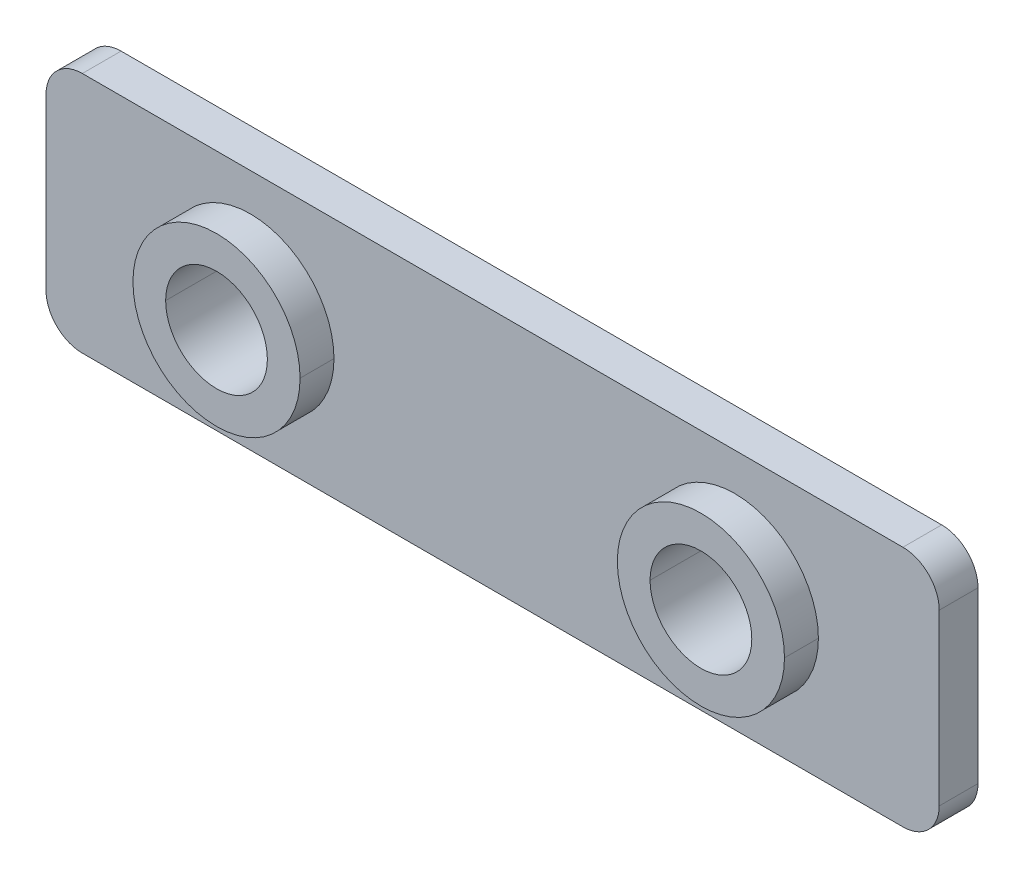
ISO-10303-21;
HEADER;
FILE_DESCRIPTION(('STEP AP214'),'2;1');
FILE_NAME('part.step','',(''),(''),'','','');
FILE_SCHEMA(('AUTOMOTIVE_DESIGN { 1 0 10303 214 1 1 1 1 }'));
ENDSEC;
DATA;
#1=APPLICATION_CONTEXT('core data for automotive mechanical design processes');
#2=APPLICATION_PROTOCOL_DEFINITION('international standard','automotive_design',2000,#1);
#3=PRODUCT_CONTEXT('',#1,'mechanical');
#4=PRODUCT('Part','Part','',(#3));
#5=PRODUCT_RELATED_PRODUCT_CATEGORY('part','',(#4));
#6=PRODUCT_DEFINITION_FORMATION('','',#4);
#7=PRODUCT_DEFINITION_CONTEXT('part definition',#1,'design');
#8=PRODUCT_DEFINITION('design','',#6,#7);
#9=PRODUCT_DEFINITION_SHAPE('','',#8);
#10=(LENGTH_UNIT() NAMED_UNIT(*) SI_UNIT(.MILLI.,.METRE.));
#11=(NAMED_UNIT(*) PLANE_ANGLE_UNIT() SI_UNIT($,.RADIAN.));
#12=(NAMED_UNIT(*) SI_UNIT($,.STERADIAN.) SOLID_ANGLE_UNIT());
#13=UNCERTAINTY_MEASURE_WITH_UNIT(LENGTH_MEASURE(1.E-05),#10,'distance_accuracy_value','');
#14=(GEOMETRIC_REPRESENTATION_CONTEXT(3) GLOBAL_UNCERTAINTY_ASSIGNED_CONTEXT((#13)) GLOBAL_UNIT_ASSIGNED_CONTEXT((#10,
#11,#12)) REPRESENTATION_CONTEXT('',''));
#15=CARTESIAN_POINT('',(0.,0.,0.));
#16=DIRECTION('',(0.,0.,1.));
#17=DIRECTION('',(1.,0.,0.));
#18=AXIS2_PLACEMENT_3D('',#15,#16,#17);
#19=CARTESIAN_POINT('',(8.44,5.,3.));
#20=DIRECTION('',(0.,0.,1.));
#21=DIRECTION('',(1.,0.,0.));
#22=AXIS2_PLACEMENT_3D('',#19,#20,#21);
#23=CYLINDRICAL_SURFACE('',#22,2.1);
#24=DIRECTION('',(0.,0.,1.));
#25=VECTOR('',#24,1.);
#26=CARTESIAN_POINT('',(6.34,5.,3.));
#27=LINE('',#26,#25);
#28=CARTESIAN_POINT('',(6.34,5.,0.));
#29=VERTEX_POINT('',#28);
#30=CARTESIAN_POINT('',(6.34,5.,3.));
#31=VERTEX_POINT('',#30);
#32=EDGE_CURVE('E220',#29,#31,#27,.T.);
#33=ORIENTED_EDGE('',*,*,#32,.F.);
#34=CARTESIAN_POINT('',(8.44,5.,0.));
#35=DIRECTION('',(0.,0.,1.));
#36=DIRECTION('',(1.,0.,0.));
#37=AXIS2_PLACEMENT_3D('',#34,#35,#36);
#38=CIRCLE('',#37,2.1);
#39=CARTESIAN_POINT('',(10.54,5.,0.));
#40=VERTEX_POINT('',#39);
#41=EDGE_CURVE('E205',#40,#29,#38,.T.);
#42=ORIENTED_EDGE('',*,*,#41,.F.);
#43=DIRECTION('',(0.,0.,1.));
#44=VECTOR('',#43,1.);
#45=CARTESIAN_POINT('',(10.54,5.,3.));
#46=LINE('',#45,#44);
#47=CARTESIAN_POINT('',(10.54,5.,3.));
#48=VERTEX_POINT('',#47);
#49=EDGE_CURVE('E225',#40,#48,#46,.T.);
#50=ORIENTED_EDGE('',*,*,#49,.T.);
#51=CARTESIAN_POINT('',(8.44,5.,3.));
#52=DIRECTION('',(0.,0.,1.));
#53=DIRECTION('',(1.,0.,0.));
#54=AXIS2_PLACEMENT_3D('',#51,#52,#53);
#55=CIRCLE('',#54,2.1);
#56=EDGE_CURVE('E200',#48,#31,#55,.T.);
#57=ORIENTED_EDGE('',*,*,#56,.T.);
#58=EDGE_LOOP('',(#33,#42,#50,#57));
#59=FACE_BOUND('',#58,.T.);
#60=ADVANCED_FACE('F17',(#59),#23,.F.);
#61=CARTESIAN_POINT('',(28.44,5.,3.));
#62=DIRECTION('',(0.,0.,1.));
#63=DIRECTION('',(1.,0.,0.));
#64=AXIS2_PLACEMENT_3D('',#61,#62,#63);
#65=CYLINDRICAL_SURFACE('',#64,2.1);
#66=DIRECTION('',(0.,0.,1.));
#67=VECTOR('',#66,1.);
#68=CARTESIAN_POINT('',(26.34,5.,3.));
#69=LINE('',#68,#67);
#70=CARTESIAN_POINT('',(26.34,5.,0.));
#71=VERTEX_POINT('',#70);
#72=CARTESIAN_POINT('',(26.34,5.,3.));
#73=VERTEX_POINT('',#72);
#74=EDGE_CURVE('E230',#71,#73,#69,.T.);
#75=ORIENTED_EDGE('',*,*,#74,.F.);
#76=CARTESIAN_POINT('',(28.44,5.,0.));
#77=DIRECTION('',(0.,0.,1.));
#78=DIRECTION('',(1.,0.,0.));
#79=AXIS2_PLACEMENT_3D('',#76,#77,#78);
#80=CIRCLE('',#79,2.1);
#81=CARTESIAN_POINT('',(30.54,5.,0.));
#82=VERTEX_POINT('',#81);
#83=EDGE_CURVE('E100',#82,#71,#80,.T.);
#84=ORIENTED_EDGE('',*,*,#83,.F.);
#85=DIRECTION('',(0.,0.,1.));
#86=VECTOR('',#85,1.);
#87=CARTESIAN_POINT('',(30.54,5.,3.));
#88=LINE('',#87,#86);
#89=CARTESIAN_POINT('',(30.54,5.,3.));
#90=VERTEX_POINT('',#89);
#91=EDGE_CURVE('E259',#82,#90,#88,.T.);
#92=ORIENTED_EDGE('',*,*,#91,.T.);
#93=CARTESIAN_POINT('',(28.44,5.,3.));
#94=DIRECTION('',(0.,0.,1.));
#95=DIRECTION('',(1.,0.,0.));
#96=AXIS2_PLACEMENT_3D('',#93,#94,#95);
#97=CIRCLE('',#96,2.1);
#98=EDGE_CURVE('E11',#90,#73,#97,.T.);
#99=ORIENTED_EDGE('',*,*,#98,.T.);
#100=EDGE_LOOP('',(#75,#84,#92,#99));
#101=FACE_BOUND('',#100,.T.);
#102=ADVANCED_FACE('F533',(#101),#65,.F.);
#103=CARTESIAN_POINT('',(28.44,5.,3.));
#104=DIRECTION('',(0.,0.,-1.));
#105=DIRECTION('',(0.,-1.,0.));
#106=AXIS2_PLACEMENT_3D('',#103,#104,#105);
#107=PLANE('',#106);
#108=ORIENTED_EDGE('',*,*,#98,.F.);
#109=CARTESIAN_POINT('',(28.44,5.,3.));
#110=DIRECTION('',(0.,0.,1.));
#111=DIRECTION('',(1.,0.,0.));
#112=AXIS2_PLACEMENT_3D('',#109,#110,#111);
#113=CIRCLE('',#112,2.1);
#114=EDGE_CURVE('E234',#73,#90,#113,.T.);
#115=ORIENTED_EDGE('',*,*,#114,.F.);
#116=EDGE_LOOP('',(#108,#115));
#117=FACE_BOUND('',#116,.T.);
#118=CARTESIAN_POINT('',(28.44,5.,3.));
#119=DIRECTION('',(0.,0.,1.));
#120=DIRECTION('',(-1.,0.,0.));
#121=AXIS2_PLACEMENT_3D('',#118,#119,#120);
#122=CIRCLE('',#121,3.45);
#123=CARTESIAN_POINT('',(24.99,5.,3.));
#124=VERTEX_POINT('',#123);
#125=CARTESIAN_POINT('',(31.89,5.,3.));
#126=VERTEX_POINT('',#125);
#127=EDGE_CURVE('E28',#124,#126,#122,.T.);
#128=ORIENTED_EDGE('',*,*,#127,.T.);
#129=CARTESIAN_POINT('',(28.44,5.,3.));
#130=DIRECTION('',(0.,0.,1.));
#131=DIRECTION('',(-1.,0.,0.));
#132=AXIS2_PLACEMENT_3D('',#129,#130,#131);
#133=CIRCLE('',#132,3.45);
#134=EDGE_CURVE('E21',#126,#124,#133,.T.);
#135=ORIENTED_EDGE('',*,*,#134,.T.);
#136=EDGE_LOOP('',(#128,#135));
#137=FACE_BOUND('',#136,.T.);
#138=ADVANCED_FACE('F537',(#117,#137),#107,.F.);
#139=CARTESIAN_POINT('',(28.44,5.,3.));
#140=DIRECTION('',(0.,0.,-1.));
#141=DIRECTION('',(-1.,0.,0.));
#142=AXIS2_PLACEMENT_3D('',#139,#140,#141);
#143=CYLINDRICAL_SURFACE('',#142,3.45);
#144=DIRECTION('',(0.,0.,-1.));
#145=VECTOR('',#144,1.);
#146=CARTESIAN_POINT('',(31.89,5.,3.));
#147=LINE('',#146,#145);
#148=CARTESIAN_POINT('',(31.89,5.,1.6));
#149=VERTEX_POINT('',#148);
#150=EDGE_CURVE('E244',#126,#149,#147,.T.);
#151=ORIENTED_EDGE('',*,*,#150,.F.);
#152=ORIENTED_EDGE('',*,*,#127,.F.);
#153=DIRECTION('',(0.,0.,-1.));
#154=VECTOR('',#153,1.);
#155=CARTESIAN_POINT('',(24.99,5.,3.));
#156=LINE('',#155,#154);
#157=CARTESIAN_POINT('',(24.99,5.,1.6));
#158=VERTEX_POINT('',#157);
#159=EDGE_CURVE('E270',#124,#158,#156,.T.);
#160=ORIENTED_EDGE('',*,*,#159,.T.);
#161=CARTESIAN_POINT('',(28.44,5.,1.6));
#162=DIRECTION('',(0.,0.,1.));
#163=DIRECTION('',(-1.,0.,0.));
#164=AXIS2_PLACEMENT_3D('',#161,#162,#163);
#165=CIRCLE('',#164,3.45);
#166=EDGE_CURVE('E219',#158,#149,#165,.T.);
#167=ORIENTED_EDGE('',*,*,#166,.T.);
#168=EDGE_LOOP('',(#151,#152,#160,#167));
#169=FACE_BOUND('',#168,.T.);
#170=ADVANCED_FACE('F573',(#169),#143,.T.);
#171=CARTESIAN_POINT('',(8.44,5.,3.));
#172=DIRECTION('',(0.,0.,1.));
#173=DIRECTION('',(1.,0.,0.));
#174=AXIS2_PLACEMENT_3D('',#171,#172,#173);
#175=PLANE('',#174);
#176=ORIENTED_EDGE('',*,*,#56,.F.);
#177=CARTESIAN_POINT('',(8.44,5.,3.));
#178=DIRECTION('',(0.,0.,1.));
#179=DIRECTION('',(1.,0.,0.));
#180=AXIS2_PLACEMENT_3D('',#177,#178,#179);
#181=CIRCLE('',#180,2.1);
#182=EDGE_CURVE('E186',#31,#48,#181,.T.);
#183=ORIENTED_EDGE('',*,*,#182,.F.);
#184=EDGE_LOOP('',(#176,#183));
#185=FACE_BOUND('',#184,.T.);
#186=CARTESIAN_POINT('',(8.44,5.,3.));
#187=DIRECTION('',(0.,0.,1.));
#188=DIRECTION('',(1.,0.,0.));
#189=AXIS2_PLACEMENT_3D('',#186,#187,#188);
#190=CIRCLE('',#189,3.45);
#191=CARTESIAN_POINT('',(4.99,5.,3.));
#192=VERTEX_POINT('',#191);
#193=CARTESIAN_POINT('',(11.89,5.,3.));
#194=VERTEX_POINT('',#193);
#195=EDGE_CURVE('E238',#192,#194,#190,.T.);
#196=ORIENTED_EDGE('',*,*,#195,.T.);
#197=CARTESIAN_POINT('',(8.44,5.,3.));
#198=DIRECTION('',(0.,0.,1.));
#199=DIRECTION('',(1.,0.,0.));
#200=AXIS2_PLACEMENT_3D('',#197,#198,#199);
#201=CIRCLE('',#200,3.45);
#202=EDGE_CURVE('E193',#194,#192,#201,.T.);
#203=ORIENTED_EDGE('',*,*,#202,.T.);
#204=EDGE_LOOP('',(#196,#203));
#205=FACE_BOUND('',#204,.T.);
#206=ADVANCED_FACE('F577',(#185,#205),#175,.T.);
#207=CARTESIAN_POINT('',(8.44,5.,3.));
#208=DIRECTION('',(0.,0.,-1.));
#209=DIRECTION('',(-1.,0.,0.));
#210=AXIS2_PLACEMENT_3D('',#207,#208,#209);
#211=CYLINDRICAL_SURFACE('',#210,3.45);
#212=DIRECTION('',(0.,0.,-1.));
#213=VECTOR('',#212,1.);
#214=CARTESIAN_POINT('',(11.89,5.,3.));
#215=LINE('',#214,#213);
#216=CARTESIAN_POINT('',(11.89,5.,1.6));
#217=VERTEX_POINT('',#216);
#218=EDGE_CURVE('E188',#194,#217,#215,.T.);
#219=ORIENTED_EDGE('',*,*,#218,.F.);
#220=ORIENTED_EDGE('',*,*,#195,.F.);
#221=DIRECTION('',(0.,0.,-1.));
#222=VECTOR('',#221,1.);
#223=CARTESIAN_POINT('',(4.99,5.,3.));
#224=LINE('',#223,#222);
#225=CARTESIAN_POINT('',(4.99,5.,1.6));
#226=VERTEX_POINT('',#225);
#227=EDGE_CURVE('E194',#192,#226,#224,.T.);
#228=ORIENTED_EDGE('',*,*,#227,.T.);
#229=CARTESIAN_POINT('',(8.44,5.,1.6));
#230=DIRECTION('',(0.,0.,1.));
#231=DIRECTION('',(-1.,0.,0.));
#232=AXIS2_PLACEMENT_3D('',#229,#230,#231);
#233=CIRCLE('',#232,3.45);
#234=EDGE_CURVE('E262',#226,#217,#233,.T.);
#235=ORIENTED_EDGE('',*,*,#234,.T.);
#236=EDGE_LOOP('',(#219,#220,#228,#235));
#237=FACE_BOUND('',#236,.T.);
#238=ADVANCED_FACE('F624',(#237),#211,.T.);
#239=CARTESIAN_POINT('',(35.38,8.5,0.));
#240=DIRECTION('',(0.,0.,-1.));
#241=DIRECTION('',(0.,-1.,0.));
#242=AXIS2_PLACEMENT_3D('',#239,#240,#241);
#243=PLANE('',#242);
#244=ORIENTED_EDGE('',*,*,#83,.T.);
#245=CARTESIAN_POINT('',(28.44,5.,0.));
#246=DIRECTION('',(0.,0.,1.));
#247=DIRECTION('',(1.,0.,0.));
#248=AXIS2_PLACEMENT_3D('',#245,#246,#247);
#249=CIRCLE('',#248,2.1);
#250=EDGE_CURVE('E229',#71,#82,#249,.T.);
#251=ORIENTED_EDGE('',*,*,#250,.T.);
#252=EDGE_LOOP('',(#244,#251));
#253=FACE_BOUND('',#252,.T.);
#254=ORIENTED_EDGE('',*,*,#41,.T.);
#255=CARTESIAN_POINT('',(8.44,5.,0.));
#256=DIRECTION('',(0.,0.,1.));
#257=DIRECTION('',(1.,0.,0.));
#258=AXIS2_PLACEMENT_3D('',#255,#256,#257);
#259=CIRCLE('',#258,2.1);
#260=EDGE_CURVE('E223',#29,#40,#259,.T.);
#261=ORIENTED_EDGE('',*,*,#260,.T.);
#262=EDGE_LOOP('',(#254,#261));
#263=FACE_BOUND('',#262,.T.);
#264=CARTESIAN_POINT('',(35.38,8.5,0.));
#265=DIRECTION('',(0.,0.,1.));
#266=DIRECTION('',(-1.,0.,0.));
#267=AXIS2_PLACEMENT_3D('',#264,#265,#266);
#268=CIRCLE('',#267,1.5);
#269=CARTESIAN_POINT('',(36.88,8.5,0.));
#270=VERTEX_POINT('',#269);
#271=CARTESIAN_POINT('',(35.38,10.,0.));
#272=VERTEX_POINT('',#271);
#273=EDGE_CURVE('E214',#270,#272,#268,.T.);
#274=ORIENTED_EDGE('',*,*,#273,.F.);
#275=DIRECTION('',(0.,1.,0.));
#276=VECTOR('',#275,1.);
#277=CARTESIAN_POINT('',(36.88,1.5,0.));
#278=LINE('',#277,#276);
#279=CARTESIAN_POINT('',(36.88,1.5,0.));
#280=VERTEX_POINT('',#279);
#281=EDGE_CURVE('E43',#280,#270,#278,.T.);
#282=ORIENTED_EDGE('',*,*,#281,.F.);
#283=CARTESIAN_POINT('',(35.38,1.5,0.));
#284=DIRECTION('',(0.,0.,1.));
#285=DIRECTION('',(1.,0.,0.));
#286=AXIS2_PLACEMENT_3D('',#283,#284,#285);
#287=CIRCLE('',#286,1.5);
#288=CARTESIAN_POINT('',(35.38,0.,0.));
#289=VERTEX_POINT('',#288);
#290=EDGE_CURVE('E156',#289,#280,#287,.T.);
#291=ORIENTED_EDGE('',*,*,#290,.F.);
#292=DIRECTION('',(1.,0.,0.));
#293=VECTOR('',#292,1.);
#294=CARTESIAN_POINT('',(1.5,0.,0.));
#295=LINE('',#294,#293);
#296=CARTESIAN_POINT('',(1.5,0.,0.));
#297=VERTEX_POINT('',#296);
#298=EDGE_CURVE('E153',#297,#289,#295,.T.);
#299=ORIENTED_EDGE('',*,*,#298,.F.);
#300=CARTESIAN_POINT('',(1.5,1.5,0.));
#301=DIRECTION('',(0.,0.,1.));
#302=DIRECTION('',(-1.,0.,0.));
#303=AXIS2_PLACEMENT_3D('',#300,#301,#302);
#304=CIRCLE('',#303,1.5);
#305=CARTESIAN_POINT('',(0.,1.5,0.));
#306=VERTEX_POINT('',#305);
#307=EDGE_CURVE('E148',#306,#297,#304,.T.);
#308=ORIENTED_EDGE('',*,*,#307,.F.);
#309=DIRECTION('',(0.,-1.,0.));
#310=VECTOR('',#309,1.);
#311=CARTESIAN_POINT('',(0.,1.5,0.));
#312=LINE('',#311,#310);
#313=CARTESIAN_POINT('',(0.,8.5,0.));
#314=VERTEX_POINT('',#313);
#315=EDGE_CURVE('E182',#314,#306,#312,.T.);
#316=ORIENTED_EDGE('',*,*,#315,.F.);
#317=CARTESIAN_POINT('',(1.5,8.5,0.));
#318=DIRECTION('',(0.,0.,1.));
#319=DIRECTION('',(-1.,0.,0.));
#320=AXIS2_PLACEMENT_3D('',#317,#318,#319);
#321=CIRCLE('',#320,1.5);
#322=CARTESIAN_POINT('',(1.5,10.,0.));
#323=VERTEX_POINT('',#322);
#324=EDGE_CURVE('E289',#323,#314,#321,.T.);
#325=ORIENTED_EDGE('',*,*,#324,.F.);
#326=DIRECTION('',(-1.,0.,0.));
#327=VECTOR('',#326,1.);
#328=CARTESIAN_POINT('',(1.5,10.,0.));
#329=LINE('',#328,#327);
#330=EDGE_CURVE('E290',#272,#323,#329,.T.);
#331=ORIENTED_EDGE('',*,*,#330,.F.);
#332=EDGE_LOOP('',(#274,#282,#291,#299,#308,#316,#325,#331));
#333=FACE_BOUND('',#332,.T.);
#334=ADVANCED_FACE('F19',(#253,#263,#333),#243,.T.);
#335=CARTESIAN_POINT('',(36.88,1.5,1.6));
#336=DIRECTION('',(-1.,0.,0.));
#337=DIRECTION('',(0.,0.,1.));
#338=AXIS2_PLACEMENT_3D('',#335,#336,#337);
#339=PLANE('',#338);
#340=ORIENTED_EDGE('',*,*,#281,.T.);
#341=DIRECTION('',(0.,0.,-1.));
#342=VECTOR('',#341,1.);
#343=CARTESIAN_POINT('',(36.88,8.5,1.6));
#344=LINE('',#343,#342);
#345=CARTESIAN_POINT('',(36.88,8.5,1.6));
#346=VERTEX_POINT('',#345);
#347=EDGE_CURVE('E302',#346,#270,#344,.T.);
#348=ORIENTED_EDGE('',*,*,#347,.F.);
#349=DIRECTION('',(0.,1.,0.));
#350=VECTOR('',#349,1.);
#351=CARTESIAN_POINT('',(36.88,1.5,1.6));
#352=LINE('',#351,#350);
#353=CARTESIAN_POINT('',(36.88,1.5,1.6));
#354=VERTEX_POINT('',#353);
#355=EDGE_CURVE('E266',#354,#346,#352,.T.);
#356=ORIENTED_EDGE('',*,*,#355,.F.);
#357=DIRECTION('',(0.,0.,-1.));
#358=VECTOR('',#357,1.);
#359=CARTESIAN_POINT('',(36.88,1.5,1.6));
#360=LINE('',#359,#358);
#361=EDGE_CURVE('E204',#354,#280,#360,.T.);
#362=ORIENTED_EDGE('',*,*,#361,.T.);
#363=EDGE_LOOP('',(#340,#348,#356,#362));
#364=FACE_BOUND('',#363,.T.);
#365=ADVANCED_FACE('F567',(#364),#339,.F.);
#366=CARTESIAN_POINT('',(35.38,1.5,1.6));
#367=DIRECTION('',(0.,0.,-1.));
#368=DIRECTION('',(-1.,0.,0.));
#369=AXIS2_PLACEMENT_3D('',#366,#367,#368);
#370=CYLINDRICAL_SURFACE('',#369,1.5);
#371=ORIENTED_EDGE('',*,*,#290,.T.);
#372=ORIENTED_EDGE('',*,*,#361,.F.);
#373=CARTESIAN_POINT('',(35.38,1.5,1.6));
#374=DIRECTION('',(0.,0.,1.));
#375=DIRECTION('',(1.,0.,0.));
#376=AXIS2_PLACEMENT_3D('',#373,#374,#375);
#377=CIRCLE('',#376,1.5);
#378=CARTESIAN_POINT('',(35.38,0.,1.6));
#379=VERTEX_POINT('',#378);
#380=EDGE_CURVE('E251',#379,#354,#377,.T.);
#381=ORIENTED_EDGE('',*,*,#380,.F.);
#382=DIRECTION('',(0.,0.,-1.));
#383=VECTOR('',#382,1.);
#384=CARTESIAN_POINT('',(35.38,0.,1.6));
#385=LINE('',#384,#383);
#386=EDGE_CURVE('E160',#379,#289,#385,.T.);
#387=ORIENTED_EDGE('',*,*,#386,.T.);
#388=EDGE_LOOP('',(#371,#372,#381,#387));
#389=FACE_BOUND('',#388,.T.);
#390=ADVANCED_FACE('F563',(#389),#370,.T.);
#391=CARTESIAN_POINT('',(1.5,0.,1.6));
#392=DIRECTION('',(0.,1.,0.));
#393=DIRECTION('',(1.,0.,0.));
#394=AXIS2_PLACEMENT_3D('',#391,#392,#393);
#395=PLANE('',#394);
#396=ORIENTED_EDGE('',*,*,#298,.T.);
#397=ORIENTED_EDGE('',*,*,#386,.F.);
#398=DIRECTION('',(1.,0.,0.));
#399=VECTOR('',#398,1.);
#400=CARTESIAN_POINT('',(1.5,0.,1.6));
#401=LINE('',#400,#399);
#402=CARTESIAN_POINT('',(1.5,0.,1.6));
#403=VERTEX_POINT('',#402);
#404=EDGE_CURVE('E167',#403,#379,#401,.T.);
#405=ORIENTED_EDGE('',*,*,#404,.F.);
#406=DIRECTION('',(0.,0.,-1.));
#407=VECTOR('',#406,1.);
#408=CARTESIAN_POINT('',(1.5,0.,1.6));
#409=LINE('',#408,#407);
#410=EDGE_CURVE('E161',#403,#297,#409,.T.);
#411=ORIENTED_EDGE('',*,*,#410,.T.);
#412=EDGE_LOOP('',(#396,#397,#405,#411));
#413=FACE_BOUND('',#412,.T.);
#414=ADVANCED_FACE('F165',(#413),#395,.F.);
#415=CARTESIAN_POINT('',(1.5,1.5,1.6));
#416=DIRECTION('',(0.,0.,-1.));
#417=DIRECTION('',(-1.,0.,0.));
#418=AXIS2_PLACEMENT_3D('',#415,#416,#417);
#419=CYLINDRICAL_SURFACE('',#418,1.5);
#420=ORIENTED_EDGE('',*,*,#307,.T.);
#421=ORIENTED_EDGE('',*,*,#410,.F.);
#422=CARTESIAN_POINT('',(1.5,1.5,1.6));
#423=DIRECTION('',(0.,0.,1.));
#424=DIRECTION('',(-1.,0.,0.));
#425=AXIS2_PLACEMENT_3D('',#422,#423,#424);
#426=CIRCLE('',#425,1.5);
#427=CARTESIAN_POINT('',(0.,1.5,1.6));
#428=VERTEX_POINT('',#427);
#429=EDGE_CURVE('E252',#428,#403,#426,.T.);
#430=ORIENTED_EDGE('',*,*,#429,.F.);
#431=DIRECTION('',(0.,0.,-1.));
#432=VECTOR('',#431,1.);
#433=CARTESIAN_POINT('',(0.,1.5,1.6));
#434=LINE('',#433,#432);
#435=EDGE_CURVE('E175',#428,#306,#434,.T.);
#436=ORIENTED_EDGE('',*,*,#435,.T.);
#437=EDGE_LOOP('',(#420,#421,#430,#436));
#438=FACE_BOUND('',#437,.T.);
#439=ADVANCED_FACE('F173',(#438),#419,.T.);
#440=CARTESIAN_POINT('',(0.,1.5,1.6));
#441=DIRECTION('',(1.,0.,0.));
#442=DIRECTION('',(0.,1.,0.));
#443=AXIS2_PLACEMENT_3D('',#440,#441,#442);
#444=PLANE('',#443);
#445=ORIENTED_EDGE('',*,*,#315,.T.);
#446=ORIENTED_EDGE('',*,*,#435,.F.);
#447=DIRECTION('',(0.,-1.,0.));
#448=VECTOR('',#447,1.);
#449=CARTESIAN_POINT('',(0.,1.5,1.6));
#450=LINE('',#449,#448);
#451=CARTESIAN_POINT('',(0.,8.5,1.6));
#452=VERTEX_POINT('',#451);
#453=EDGE_CURVE('E212',#452,#428,#450,.T.);
#454=ORIENTED_EDGE('',*,*,#453,.F.);
#455=DIRECTION('',(0.,0.,-1.));
#456=VECTOR('',#455,1.);
#457=CARTESIAN_POINT('',(0.,8.5,1.6));
#458=LINE('',#457,#456);
#459=EDGE_CURVE('E276',#452,#314,#458,.T.);
#460=ORIENTED_EDGE('',*,*,#459,.T.);
#461=EDGE_LOOP('',(#445,#446,#454,#460));
#462=FACE_BOUND('',#461,.T.);
#463=ADVANCED_FACE('F586',(#462),#444,.F.);
#464=CARTESIAN_POINT('',(1.5,8.5,1.6));
#465=DIRECTION('',(0.,0.,-1.));
#466=DIRECTION('',(-1.,0.,0.));
#467=AXIS2_PLACEMENT_3D('',#464,#465,#466);
#468=CYLINDRICAL_SURFACE('',#467,1.5);
#469=ORIENTED_EDGE('',*,*,#324,.T.);
#470=ORIENTED_EDGE('',*,*,#459,.F.);
#471=CARTESIAN_POINT('',(1.5,8.5,1.6));
#472=DIRECTION('',(0.,0.,1.));
#473=DIRECTION('',(-1.,0.,0.));
#474=AXIS2_PLACEMENT_3D('',#471,#472,#473);
#475=CIRCLE('',#474,1.5);
#476=CARTESIAN_POINT('',(1.5,10.,1.6));
#477=VERTEX_POINT('',#476);
#478=EDGE_CURVE('E208',#477,#452,#475,.T.);
#479=ORIENTED_EDGE('',*,*,#478,.F.);
#480=DIRECTION('',(0.,0.,-1.));
#481=VECTOR('',#480,1.);
#482=CARTESIAN_POINT('',(1.5,10.,1.6));
#483=LINE('',#482,#481);
#484=EDGE_CURVE('E285',#477,#323,#483,.T.);
#485=ORIENTED_EDGE('',*,*,#484,.T.);
#486=EDGE_LOOP('',(#469,#470,#479,#485));
#487=FACE_BOUND('',#486,.T.);
#488=ADVANCED_FACE('F633',(#487),#468,.T.);
#489=CARTESIAN_POINT('',(1.5,10.,1.6));
#490=DIRECTION('',(0.,-1.,0.));
#491=DIRECTION('',(0.,0.,-1.));
#492=AXIS2_PLACEMENT_3D('',#489,#490,#491);
#493=PLANE('',#492);
#494=ORIENTED_EDGE('',*,*,#330,.T.);
#495=ORIENTED_EDGE('',*,*,#484,.F.);
#496=DIRECTION('',(-1.,0.,0.));
#497=VECTOR('',#496,1.);
#498=CARTESIAN_POINT('',(1.5,10.,1.6));
#499=LINE('',#498,#497);
#500=CARTESIAN_POINT('',(35.38,10.,1.6));
#501=VERTEX_POINT('',#500);
#502=EDGE_CURVE('E213',#501,#477,#499,.T.);
#503=ORIENTED_EDGE('',*,*,#502,.F.);
#504=DIRECTION('',(0.,0.,-1.));
#505=VECTOR('',#504,1.);
#506=CARTESIAN_POINT('',(35.38,10.,1.6));
#507=LINE('',#506,#505);
#508=EDGE_CURVE('E218',#501,#272,#507,.T.);
#509=ORIENTED_EDGE('',*,*,#508,.T.);
#510=EDGE_LOOP('',(#494,#495,#503,#509));
#511=FACE_BOUND('',#510,.T.);
#512=ADVANCED_FACE('F602',(#511),#493,.F.);
#513=CARTESIAN_POINT('',(35.38,8.5,1.6));
#514=DIRECTION('',(0.,0.,-1.));
#515=DIRECTION('',(-1.,0.,0.));
#516=AXIS2_PLACEMENT_3D('',#513,#514,#515);
#517=CYLINDRICAL_SURFACE('',#516,1.5);
#518=ORIENTED_EDGE('',*,*,#273,.T.);
#519=ORIENTED_EDGE('',*,*,#508,.F.);
#520=CARTESIAN_POINT('',(35.38,8.5,1.6));
#521=DIRECTION('',(0.,0.,1.));
#522=DIRECTION('',(-1.,0.,0.));
#523=AXIS2_PLACEMENT_3D('',#520,#521,#522);
#524=CIRCLE('',#523,1.5);
#525=EDGE_CURVE('E198',#346,#501,#524,.T.);
#526=ORIENTED_EDGE('',*,*,#525,.F.);
#527=ORIENTED_EDGE('',*,*,#347,.T.);
#528=EDGE_LOOP('',(#518,#519,#526,#527));
#529=FACE_BOUND('',#528,.T.);
#530=ADVANCED_FACE('F557',(#529),#517,.T.);
#531=CARTESIAN_POINT('',(35.38,8.5,1.6));
#532=DIRECTION('',(0.,0.,-1.));
#533=DIRECTION('',(0.,-1.,0.));
#534=AXIS2_PLACEMENT_3D('',#531,#532,#533);
#535=PLANE('',#534);
#536=ORIENTED_EDGE('',*,*,#166,.F.);
#537=CARTESIAN_POINT('',(28.44,5.,1.6));
#538=DIRECTION('',(0.,0.,1.));
#539=DIRECTION('',(-1.,0.,0.));
#540=AXIS2_PLACEMENT_3D('',#537,#538,#539);
#541=CIRCLE('',#540,3.45);
#542=EDGE_CURVE('E248',#149,#158,#541,.T.);
#543=ORIENTED_EDGE('',*,*,#542,.F.);
#544=EDGE_LOOP('',(#536,#543));
#545=FACE_BOUND('',#544,.T.);
#546=ORIENTED_EDGE('',*,*,#234,.F.);
#547=CARTESIAN_POINT('',(8.44,5.,1.6));
#548=DIRECTION('',(0.,0.,1.));
#549=DIRECTION('',(-1.,0.,0.));
#550=AXIS2_PLACEMENT_3D('',#547,#548,#549);
#551=CIRCLE('',#550,3.45);
#552=EDGE_CURVE('E192',#217,#226,#551,.T.);
#553=ORIENTED_EDGE('',*,*,#552,.F.);
#554=EDGE_LOOP('',(#546,#553));
#555=FACE_BOUND('',#554,.T.);
#556=ORIENTED_EDGE('',*,*,#525,.T.);
#557=ORIENTED_EDGE('',*,*,#502,.T.);
#558=ORIENTED_EDGE('',*,*,#478,.T.);
#559=ORIENTED_EDGE('',*,*,#453,.T.);
#560=ORIENTED_EDGE('',*,*,#429,.T.);
#561=ORIENTED_EDGE('',*,*,#404,.T.);
#562=ORIENTED_EDGE('',*,*,#380,.T.);
#563=ORIENTED_EDGE('',*,*,#355,.T.);
#564=EDGE_LOOP('',(#556,#557,#558,#559,#560,#561,#562,#563));
#565=FACE_BOUND('',#564,.T.);
#566=ADVANCED_FACE('F553',(#545,#555,#565),#535,.F.);
#567=CARTESIAN_POINT('',(8.44,5.,3.));
#568=DIRECTION('',(0.,0.,-1.));
#569=DIRECTION('',(-1.,0.,0.));
#570=AXIS2_PLACEMENT_3D('',#567,#568,#569);
#571=CYLINDRICAL_SURFACE('',#570,3.45);
#572=ORIENTED_EDGE('',*,*,#202,.F.);
#573=ORIENTED_EDGE('',*,*,#218,.T.);
#574=ORIENTED_EDGE('',*,*,#552,.T.);
#575=ORIENTED_EDGE('',*,*,#227,.F.);
#576=EDGE_LOOP('',(#572,#573,#574,#575));
#577=FACE_BOUND('',#576,.T.);
#578=ADVANCED_FACE('F547',(#577),#571,.T.);
#579=CARTESIAN_POINT('',(28.44,5.,3.));
#580=DIRECTION('',(0.,0.,-1.));
#581=DIRECTION('',(-1.,0.,0.));
#582=AXIS2_PLACEMENT_3D('',#579,#580,#581);
#583=CYLINDRICAL_SURFACE('',#582,3.45);
#584=ORIENTED_EDGE('',*,*,#134,.F.);
#585=ORIENTED_EDGE('',*,*,#150,.T.);
#586=ORIENTED_EDGE('',*,*,#542,.T.);
#587=ORIENTED_EDGE('',*,*,#159,.F.);
#588=EDGE_LOOP('',(#584,#585,#586,#587));
#589=FACE_BOUND('',#588,.T.);
#590=ADVANCED_FACE('F542',(#589),#583,.T.);
#591=CARTESIAN_POINT('',(28.44,5.,3.));
#592=DIRECTION('',(0.,0.,1.));
#593=DIRECTION('',(1.,0.,0.));
#594=AXIS2_PLACEMENT_3D('',#591,#592,#593);
#595=CYLINDRICAL_SURFACE('',#594,2.1);
#596=ORIENTED_EDGE('',*,*,#250,.F.);
#597=ORIENTED_EDGE('',*,*,#74,.T.);
#598=ORIENTED_EDGE('',*,*,#114,.T.);
#599=ORIENTED_EDGE('',*,*,#91,.F.);
#600=EDGE_LOOP('',(#596,#597,#598,#599));
#601=FACE_BOUND('',#600,.T.);
#602=ADVANCED_FACE('F546',(#601),#595,.F.);
#603=CARTESIAN_POINT('',(8.44,5.,3.));
#604=DIRECTION('',(0.,0.,1.));
#605=DIRECTION('',(1.,0.,0.));
#606=AXIS2_PLACEMENT_3D('',#603,#604,#605);
#607=CYLINDRICAL_SURFACE('',#606,2.1);
#608=ORIENTED_EDGE('',*,*,#260,.F.);
#609=ORIENTED_EDGE('',*,*,#32,.T.);
#610=ORIENTED_EDGE('',*,*,#182,.T.);
#611=ORIENTED_EDGE('',*,*,#49,.F.);
#612=EDGE_LOOP('',(#608,#609,#610,#611));
#613=FACE_BOUND('',#612,.T.);
#614=ADVANCED_FACE('F611',(#613),#607,.F.);
#615=CLOSED_SHELL('',(#60,#102,#138,#170,#206,#238,#334,#365,#390,#414,#439,#463,#488,#512,#530,
#566,#578,#590,#602,#614));
#616=MANIFOLD_SOLID_BREP('B1',#615);
#617=ADVANCED_BREP_SHAPE_REPRESENTATION('',(#18,#616),#14);
#618=SHAPE_DEFINITION_REPRESENTATION(#9,#617);
ENDSEC;
END-ISO-10303-21;
